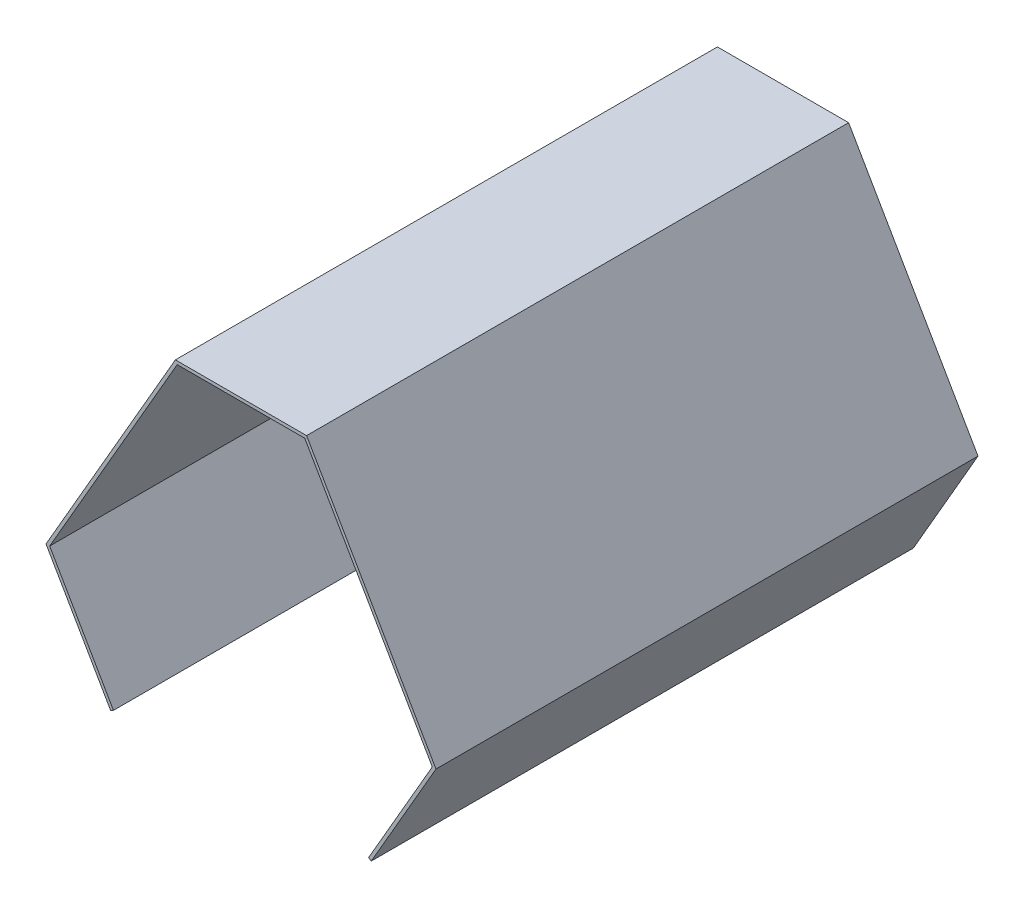
ISO-10303-21;
HEADER;
FILE_DESCRIPTION(('STEP AP214'),'2;1');
FILE_NAME('part.step','',(''),(''),'','','');
FILE_SCHEMA(('AUTOMOTIVE_DESIGN { 1 0 10303 214 1 1 1 1 }'));
ENDSEC;
DATA;
#1=APPLICATION_CONTEXT('core data for automotive mechanical design processes');
#2=APPLICATION_PROTOCOL_DEFINITION('international standard','automotive_design',2000,#1);
#3=PRODUCT_CONTEXT('',#1,'mechanical');
#4=PRODUCT('Part','Part','',(#3));
#5=PRODUCT_RELATED_PRODUCT_CATEGORY('part','',(#4));
#6=PRODUCT_DEFINITION_FORMATION('','',#4);
#7=PRODUCT_DEFINITION_CONTEXT('part definition',#1,'design');
#8=PRODUCT_DEFINITION('design','',#6,#7);
#9=PRODUCT_DEFINITION_SHAPE('','',#8);
#10=(LENGTH_UNIT() NAMED_UNIT(*) SI_UNIT(.MILLI.,.METRE.));
#11=(NAMED_UNIT(*) PLANE_ANGLE_UNIT() SI_UNIT($,.RADIAN.));
#12=(NAMED_UNIT(*) SI_UNIT($,.STERADIAN.) SOLID_ANGLE_UNIT());
#13=UNCERTAINTY_MEASURE_WITH_UNIT(LENGTH_MEASURE(1.E-05),#10,'distance_accuracy_value','');
#14=(GEOMETRIC_REPRESENTATION_CONTEXT(3) GLOBAL_UNCERTAINTY_ASSIGNED_CONTEXT((#13)) GLOBAL_UNIT_ASSIGNED_CONTEXT((#10,
#11,#12)) REPRESENTATION_CONTEXT('',''));
#15=CARTESIAN_POINT('',(0.,0.,0.));
#16=DIRECTION('',(0.,0.,1.));
#17=DIRECTION('',(1.,0.,0.));
#18=AXIS2_PLACEMENT_3D('',#15,#16,#17);
#19=CARTESIAN_POINT('',(299.999999999999,-86.6025405137754,850.));
#20=DIRECTION('',(0.866025403784441,-0.499999999999996,0.));
#21=DIRECTION('',(0.499999999999996,0.866025403784441,0.));
#22=AXIS2_PLACEMENT_3D('',#19,#20,#21);
#23=PLANE('',#22);
#24=DIRECTION('',(-0.499999999999996,-0.866025403784441,0.));
#25=VECTOR('',#24,1.);
#26=CARTESIAN_POINT('',(299.999999999999,-86.6025405137754,0.));
#27=LINE('',#26,#25);
#28=CARTESIAN_POINT('',(299.999999999999,-86.6025405137754,0.));
#29=VERTEX_POINT('',#28);
#30=CARTESIAN_POINT('',(200.,-259.807621270664,0.));
#31=VERTEX_POINT('',#30);
#32=EDGE_CURVE('E158',#29,#31,#27,.T.);
#33=ORIENTED_EDGE('',*,*,#32,.T.);
#34=DIRECTION('',(0.,0.,-1.));
#35=VECTOR('',#34,1.);
#36=CARTESIAN_POINT('',(200.,-259.807621270664,850.));
#37=LINE('',#36,#35);
#38=CARTESIAN_POINT('',(200.,-259.807621270664,850.));
#39=VERTEX_POINT('',#38);
#40=EDGE_CURVE('E11',#39,#31,#37,.T.);
#41=ORIENTED_EDGE('',*,*,#40,.F.);
#42=DIRECTION('',(-0.499999999999996,-0.866025403784441,0.));
#43=VECTOR('',#42,1.);
#44=CARTESIAN_POINT('',(299.999999999999,-86.6025405137754,850.));
#45=LINE('',#44,#43);
#46=CARTESIAN_POINT('',(299.999999999999,-86.6025405137754,850.));
#47=VERTEX_POINT('',#46);
#48=EDGE_CURVE('E180',#47,#39,#45,.T.);
#49=ORIENTED_EDGE('',*,*,#48,.F.);
#50=DIRECTION('',(0.,0.,-1.));
#51=VECTOR('',#50,1.);
#52=CARTESIAN_POINT('',(299.999999999999,-86.6025405137754,850.));
#53=LINE('',#52,#51);
#54=EDGE_CURVE('E154',#47,#29,#53,.T.);
#55=ORIENTED_EDGE('',*,*,#54,.T.);
#56=EDGE_LOOP('',(#33,#41,#49,#55));
#57=FACE_BOUND('',#56,.T.);
#58=ADVANCED_FACE('F38',(#57),#23,.F.);
#59=CARTESIAN_POINT('',(200.,-259.807621270664,850.));
#60=DIRECTION('',(0.500000000000009,0.866025403784433,0.));
#61=DIRECTION('',(-0.866025403784433,0.500000000000009,0.));
#62=AXIS2_PLACEMENT_3D('',#59,#60,#61);
#63=PLANE('',#62);
#64=DIRECTION('',(0.866025403784433,-0.500000000000009,0.));
#65=VECTOR('',#64,1.);
#66=CARTESIAN_POINT('',(200.,-259.807621270664,0.));
#67=LINE('',#66,#65);
#68=CARTESIAN_POINT('',(204.330127018921,-262.307621270663,0.));
#69=VERTEX_POINT('',#68);
#70=EDGE_CURVE('E161',#31,#69,#67,.T.);
#71=ORIENTED_EDGE('',*,*,#70,.T.);
#72=DIRECTION('',(0.,0.,-1.));
#73=VECTOR('',#72,1.);
#74=CARTESIAN_POINT('',(204.330127018921,-262.307621270663,850.));
#75=LINE('',#74,#73);
#76=CARTESIAN_POINT('',(204.330127018921,-262.307621270663,850.));
#77=VERTEX_POINT('',#76);
#78=EDGE_CURVE('E46',#77,#69,#75,.T.);
#79=ORIENTED_EDGE('',*,*,#78,.F.);
#80=DIRECTION('',(0.866025403784433,-0.500000000000009,0.));
#81=VECTOR('',#80,1.);
#82=CARTESIAN_POINT('',(200.,-259.807621270664,850.));
#83=LINE('',#82,#81);
#84=EDGE_CURVE('E109',#39,#77,#83,.T.);
#85=ORIENTED_EDGE('',*,*,#84,.F.);
#86=ORIENTED_EDGE('',*,*,#40,.T.);
#87=EDGE_LOOP('',(#71,#79,#85,#86));
#88=FACE_BOUND('',#87,.T.);
#89=ADVANCED_FACE('F258',(#88),#63,.F.);
#90=CARTESIAN_POINT('',(305.773502691895,-86.6025405137754,850.));
#91=DIRECTION('',(-0.866025403784438,0.5,0.));
#92=DIRECTION('',(-0.5,-0.866025403784439,0.));
#93=AXIS2_PLACEMENT_3D('',#90,#91,#92);
#94=PLANE('',#93);
#95=DIRECTION('',(0.5,0.866025403784438,0.));
#96=VECTOR('',#95,1.);
#97=CARTESIAN_POINT('',(305.773502691895,-86.6025405137754,0.));
#98=LINE('',#97,#96);
#99=CARTESIAN_POINT('',(305.773502691895,-86.6025405137754,0.));
#100=VERTEX_POINT('',#99);
#101=EDGE_CURVE('E163',#69,#100,#98,.T.);
#102=ORIENTED_EDGE('',*,*,#101,.T.);
#103=DIRECTION('',(0.,0.,-1.));
#104=VECTOR('',#103,1.);
#105=CARTESIAN_POINT('',(305.773502691895,-86.6025405137754,850.));
#106=LINE('',#105,#104);
#107=CARTESIAN_POINT('',(305.773502691895,-86.6025405137754,850.));
#108=VERTEX_POINT('',#107);
#109=EDGE_CURVE('E199',#108,#100,#106,.T.);
#110=ORIENTED_EDGE('',*,*,#109,.F.);
#111=DIRECTION('',(0.5,0.866025403784438,0.));
#112=VECTOR('',#111,1.);
#113=CARTESIAN_POINT('',(305.773502691895,-86.6025405137754,850.));
#114=LINE('',#113,#112);
#115=EDGE_CURVE('E207',#77,#108,#114,.T.);
#116=ORIENTED_EDGE('',*,*,#115,.F.);
#117=ORIENTED_EDGE('',*,*,#78,.T.);
#118=EDGE_LOOP('',(#102,#110,#116,#117));
#119=FACE_BOUND('',#118,.T.);
#120=ADVANCED_FACE('F205',(#119),#94,.F.);
#121=CARTESIAN_POINT('',(102.886751345947,264.807621,850.));
#122=DIRECTION('',(-0.866025403784438,-0.5,0.));
#123=DIRECTION('',(0.5,-0.866025403784439,0.));
#124=AXIS2_PLACEMENT_3D('',#121,#122,#123);
#125=PLANE('',#124);
#126=DIRECTION('',(-0.5,0.866025403784439,0.));
#127=VECTOR('',#126,1.);
#128=CARTESIAN_POINT('',(102.886751345947,264.807621,0.));
#129=LINE('',#128,#127);
#130=CARTESIAN_POINT('',(102.886751345947,264.807621,0.));
#131=VERTEX_POINT('',#130);
#132=EDGE_CURVE('E165',#100,#131,#129,.T.);
#133=ORIENTED_EDGE('',*,*,#132,.T.);
#134=DIRECTION('',(0.,0.,-1.));
#135=VECTOR('',#134,1.);
#136=CARTESIAN_POINT('',(102.886751345947,264.807621,850.));
#137=LINE('',#136,#135);
#138=CARTESIAN_POINT('',(102.886751345947,264.807621,850.));
#139=VERTEX_POINT('',#138);
#140=EDGE_CURVE('E196',#139,#131,#137,.T.);
#141=ORIENTED_EDGE('',*,*,#140,.F.);
#142=DIRECTION('',(-0.5,0.866025403784439,0.));
#143=VECTOR('',#142,1.);
#144=CARTESIAN_POINT('',(102.886751345947,264.807621,850.));
#145=LINE('',#144,#143);
#146=EDGE_CURVE('E225',#108,#139,#145,.T.);
#147=ORIENTED_EDGE('',*,*,#146,.F.);
#148=ORIENTED_EDGE('',*,*,#109,.T.);
#149=EDGE_LOOP('',(#133,#141,#147,#148));
#150=FACE_BOUND('',#149,.T.);
#151=ADVANCED_FACE('F216',(#150),#125,.F.);
#152=CARTESIAN_POINT('',(-102.886751345948,264.807621,850.));
#153=DIRECTION('',(0.,-1.,0.));
#154=DIRECTION('',(0.,0.,-1.));
#155=AXIS2_PLACEMENT_3D('',#152,#153,#154);
#156=PLANE('',#155);
#157=DIRECTION('',(-1.,0.,0.));
#158=VECTOR('',#157,1.);
#159=CARTESIAN_POINT('',(-102.886751345948,264.807621,0.));
#160=LINE('',#159,#158);
#161=CARTESIAN_POINT('',(-102.886751345948,264.807621,0.));
#162=VERTEX_POINT('',#161);
#163=EDGE_CURVE('E167',#131,#162,#160,.T.);
#164=ORIENTED_EDGE('',*,*,#163,.T.);
#165=DIRECTION('',(0.,0.,-1.));
#166=VECTOR('',#165,1.);
#167=CARTESIAN_POINT('',(-102.886751345948,264.807621,850.));
#168=LINE('',#167,#166);
#169=CARTESIAN_POINT('',(-102.886751345948,264.807621,850.));
#170=VERTEX_POINT('',#169);
#171=EDGE_CURVE('E193',#170,#162,#168,.T.);
#172=ORIENTED_EDGE('',*,*,#171,.F.);
#173=DIRECTION('',(-1.,0.,0.));
#174=VECTOR('',#173,1.);
#175=CARTESIAN_POINT('',(-102.886751345948,264.807621,850.));
#176=LINE('',#175,#174);
#177=EDGE_CURVE('E222',#139,#170,#176,.T.);
#178=ORIENTED_EDGE('',*,*,#177,.F.);
#179=ORIENTED_EDGE('',*,*,#140,.T.);
#180=EDGE_LOOP('',(#164,#172,#178,#179));
#181=FACE_BOUND('',#180,.T.);
#182=ADVANCED_FACE('F220',(#181),#156,.F.);
#183=CARTESIAN_POINT('',(-305.773502691896,-86.602540513776,850.));
#184=DIRECTION('',(0.866025403784438,-0.5,0.));
#185=DIRECTION('',(0.5,0.866025403784439,0.));
#186=AXIS2_PLACEMENT_3D('',#183,#184,#185);
#187=PLANE('',#186);
#188=DIRECTION('',(-0.5,-0.866025403784438,0.));
#189=VECTOR('',#188,1.);
#190=CARTESIAN_POINT('',(-305.773502691896,-86.602540513776,0.));
#191=LINE('',#190,#189);
#192=CARTESIAN_POINT('',(-305.773502691896,-86.602540513776,0.));
#193=VERTEX_POINT('',#192);
#194=EDGE_CURVE('E169',#162,#193,#191,.T.);
#195=ORIENTED_EDGE('',*,*,#194,.T.);
#196=DIRECTION('',(0.,0.,-1.));
#197=VECTOR('',#196,1.);
#198=CARTESIAN_POINT('',(-305.773502691896,-86.602540513776,850.));
#199=LINE('',#198,#197);
#200=CARTESIAN_POINT('',(-305.773502691896,-86.602540513776,850.));
#201=VERTEX_POINT('',#200);
#202=EDGE_CURVE('E190',#201,#193,#199,.T.);
#203=ORIENTED_EDGE('',*,*,#202,.F.);
#204=DIRECTION('',(-0.5,-0.866025403784438,0.));
#205=VECTOR('',#204,1.);
#206=CARTESIAN_POINT('',(-305.773502691896,-86.602540513776,850.));
#207=LINE('',#206,#205);
#208=EDGE_CURVE('E224',#170,#201,#207,.T.);
#209=ORIENTED_EDGE('',*,*,#208,.F.);
#210=ORIENTED_EDGE('',*,*,#171,.T.);
#211=EDGE_LOOP('',(#195,#203,#209,#210));
#212=FACE_BOUND('',#211,.T.);
#213=ADVANCED_FACE('F271',(#212),#187,.F.);
#214=CARTESIAN_POINT('',(-204.330127018922,-262.307621270664,850.));
#215=DIRECTION('',(0.866025403784438,0.5,0.));
#216=DIRECTION('',(-0.5,0.866025403784439,0.));
#217=AXIS2_PLACEMENT_3D('',#214,#215,#216);
#218=PLANE('',#217);
#219=DIRECTION('',(0.5,-0.866025403784439,0.));
#220=VECTOR('',#219,1.);
#221=CARTESIAN_POINT('',(-204.330127018922,-262.307621270664,0.));
#222=LINE('',#221,#220);
#223=CARTESIAN_POINT('',(-204.330127018922,-262.307621270664,0.));
#224=VERTEX_POINT('',#223);
#225=EDGE_CURVE('E171',#193,#224,#222,.T.);
#226=ORIENTED_EDGE('',*,*,#225,.T.);
#227=DIRECTION('',(0.,0.,-1.));
#228=VECTOR('',#227,1.);
#229=CARTESIAN_POINT('',(-204.330127018922,-262.307621270664,850.));
#230=LINE('',#229,#228);
#231=CARTESIAN_POINT('',(-204.330127018922,-262.307621270664,850.));
#232=VERTEX_POINT('',#231);
#233=EDGE_CURVE('E187',#232,#224,#230,.T.);
#234=ORIENTED_EDGE('',*,*,#233,.F.);
#235=DIRECTION('',(0.5,-0.866025403784439,0.));
#236=VECTOR('',#235,1.);
#237=CARTESIAN_POINT('',(-204.330127018922,-262.307621270664,850.));
#238=LINE('',#237,#236);
#239=EDGE_CURVE('E227',#201,#232,#238,.T.);
#240=ORIENTED_EDGE('',*,*,#239,.F.);
#241=ORIENTED_EDGE('',*,*,#202,.T.);
#242=EDGE_LOOP('',(#226,#234,#240,#241));
#243=FACE_BOUND('',#242,.T.);
#244=ADVANCED_FACE('F274',(#243),#218,.F.);
#245=CARTESIAN_POINT('',(-204.330127018922,-262.307621270664,850.));
#246=DIRECTION('',(-0.500000000000001,0.866025403784438,0.));
#247=DIRECTION('',(-0.866025403784438,-0.500000000000001,0.));
#248=AXIS2_PLACEMENT_3D('',#245,#246,#247);
#249=PLANE('',#248);
#250=DIRECTION('',(0.866025403784438,0.500000000000001,0.));
#251=VECTOR('',#250,1.);
#252=CARTESIAN_POINT('',(-204.330127018922,-262.307621270664,0.));
#253=LINE('',#252,#251);
#254=CARTESIAN_POINT('',(-200.,-259.807621270664,0.));
#255=VERTEX_POINT('',#254);
#256=EDGE_CURVE('E173',#224,#255,#253,.T.);
#257=ORIENTED_EDGE('',*,*,#256,.T.);
#258=DIRECTION('',(0.,0.,-1.));
#259=VECTOR('',#258,1.);
#260=CARTESIAN_POINT('',(-200.,-259.807621270664,850.));
#261=LINE('',#260,#259);
#262=CARTESIAN_POINT('',(-200.,-259.807621270664,850.));
#263=VERTEX_POINT('',#262);
#264=EDGE_CURVE('E184',#263,#255,#261,.T.);
#265=ORIENTED_EDGE('',*,*,#264,.F.);
#266=DIRECTION('',(0.866025403784438,0.500000000000001,0.));
#267=VECTOR('',#266,1.);
#268=CARTESIAN_POINT('',(-204.330127018922,-262.307621270664,850.));
#269=LINE('',#268,#267);
#270=EDGE_CURVE('E233',#232,#263,#269,.T.);
#271=ORIENTED_EDGE('',*,*,#270,.F.);
#272=ORIENTED_EDGE('',*,*,#233,.T.);
#273=EDGE_LOOP('',(#257,#265,#271,#272));
#274=FACE_BOUND('',#273,.T.);
#275=ADVANCED_FACE('F239',(#274),#249,.F.);
#276=CARTESIAN_POINT('',(-200.,-259.807621270664,850.));
#277=DIRECTION('',(-0.866025403784439,-0.5,0.));
#278=DIRECTION('',(0.5,-0.866025403784439,0.));
#279=AXIS2_PLACEMENT_3D('',#276,#277,#278);
#280=PLANE('',#279);
#281=DIRECTION('',(-0.5,0.866025403784439,0.));
#282=VECTOR('',#281,1.);
#283=CARTESIAN_POINT('',(-200.,-259.807621270664,0.));
#284=LINE('',#283,#282);
#285=CARTESIAN_POINT('',(-300.,-86.602540513776,0.));
#286=VERTEX_POINT('',#285);
#287=EDGE_CURVE('E175',#255,#286,#284,.T.);
#288=ORIENTED_EDGE('',*,*,#287,.T.);
#289=DIRECTION('',(0.,0.,-1.));
#290=VECTOR('',#289,1.);
#291=CARTESIAN_POINT('',(-300.,-86.602540513776,850.));
#292=LINE('',#291,#290);
#293=CARTESIAN_POINT('',(-300.,-86.602540513776,850.));
#294=VERTEX_POINT('',#293);
#295=EDGE_CURVE('E149',#294,#286,#292,.T.);
#296=ORIENTED_EDGE('',*,*,#295,.F.);
#297=DIRECTION('',(-0.5,0.866025403784439,0.));
#298=VECTOR('',#297,1.);
#299=CARTESIAN_POINT('',(-200.,-259.807621270664,850.));
#300=LINE('',#299,#298);
#301=EDGE_CURVE('E140',#263,#294,#300,.T.);
#302=ORIENTED_EDGE('',*,*,#301,.F.);
#303=ORIENTED_EDGE('',*,*,#264,.T.);
#304=EDGE_LOOP('',(#288,#296,#302,#303));
#305=FACE_BOUND('',#304,.T.);
#306=ADVANCED_FACE('F243',(#305),#280,.F.);
#307=CARTESIAN_POINT('',(-300.,-86.602540513776,850.));
#308=DIRECTION('',(-0.86602540378444,0.499999999999998,0.));
#309=DIRECTION('',(-0.499999999999998,-0.86602540378444,0.));
#310=AXIS2_PLACEMENT_3D('',#307,#308,#309);
#311=PLANE('',#310);
#312=DIRECTION('',(0.499999999999998,0.86602540378444,0.));
#313=VECTOR('',#312,1.);
#314=CARTESIAN_POINT('',(-300.,-86.602540513776,0.));
#315=LINE('',#314,#313);
#316=CARTESIAN_POINT('',(-100.000000000001,259.807621,0.));
#317=VERTEX_POINT('',#316);
#318=EDGE_CURVE('E148',#286,#317,#315,.T.);
#319=ORIENTED_EDGE('',*,*,#318,.T.);
#320=DIRECTION('',(0.,0.,-1.));
#321=VECTOR('',#320,1.);
#322=CARTESIAN_POINT('',(-100.000000000001,259.807621,850.));
#323=LINE('',#322,#321);
#324=CARTESIAN_POINT('',(-100.000000000001,259.807621,850.));
#325=VERTEX_POINT('',#324);
#326=EDGE_CURVE('E145',#325,#317,#323,.T.);
#327=ORIENTED_EDGE('',*,*,#326,.F.);
#328=DIRECTION('',(0.499999999999998,0.86602540378444,0.));
#329=VECTOR('',#328,1.);
#330=CARTESIAN_POINT('',(-300.,-86.602540513776,850.));
#331=LINE('',#330,#329);
#332=EDGE_CURVE('E134',#294,#325,#331,.T.);
#333=ORIENTED_EDGE('',*,*,#332,.F.);
#334=ORIENTED_EDGE('',*,*,#295,.T.);
#335=EDGE_LOOP('',(#319,#327,#333,#334));
#336=FACE_BOUND('',#335,.T.);
#337=ADVANCED_FACE('F146',(#336),#311,.F.);
#338=CARTESIAN_POINT('',(-100.000000000001,259.807621,850.));
#339=DIRECTION('',(0.,1.,0.));
#340=DIRECTION('',(-1.,0.,0.));
#341=AXIS2_PLACEMENT_3D('',#338,#339,#340);
#342=PLANE('',#341);
#343=DIRECTION('',(1.,0.,0.));
#344=VECTOR('',#343,1.);
#345=CARTESIAN_POINT('',(-100.000000000001,259.807621,0.));
#346=LINE('',#345,#344);
#347=CARTESIAN_POINT('',(99.9999999999992,259.807621,0.));
#348=VERTEX_POINT('',#347);
#349=EDGE_CURVE('E95',#317,#348,#346,.T.);
#350=ORIENTED_EDGE('',*,*,#349,.T.);
#351=DIRECTION('',(0.,0.,-1.));
#352=VECTOR('',#351,1.);
#353=CARTESIAN_POINT('',(99.9999999999992,259.807621,850.));
#354=LINE('',#353,#352);
#355=CARTESIAN_POINT('',(99.9999999999992,259.807621,850.));
#356=VERTEX_POINT('',#355);
#357=EDGE_CURVE('E150',#356,#348,#354,.T.);
#358=ORIENTED_EDGE('',*,*,#357,.F.);
#359=DIRECTION('',(1.,0.,0.));
#360=VECTOR('',#359,1.);
#361=CARTESIAN_POINT('',(-100.000000000001,259.807621,850.));
#362=LINE('',#361,#360);
#363=EDGE_CURVE('E138',#325,#356,#362,.T.);
#364=ORIENTED_EDGE('',*,*,#363,.F.);
#365=ORIENTED_EDGE('',*,*,#326,.T.);
#366=EDGE_LOOP('',(#350,#358,#364,#365));
#367=FACE_BOUND('',#366,.T.);
#368=ADVANCED_FACE('F152',(#367),#342,.F.);
#369=CARTESIAN_POINT('',(99.9999999999992,259.807621,850.));
#370=DIRECTION('',(0.866025403784438,0.5,0.));
#371=DIRECTION('',(-0.5,0.866025403784439,0.));
#372=AXIS2_PLACEMENT_3D('',#369,#370,#371);
#373=PLANE('',#372);
#374=DIRECTION('',(0.5,-0.866025403784438,0.));
#375=VECTOR('',#374,1.);
#376=CARTESIAN_POINT('',(99.9999999999992,259.807621,0.));
#377=LINE('',#376,#375);
#378=EDGE_CURVE('E101',#348,#29,#377,.T.);
#379=ORIENTED_EDGE('',*,*,#378,.T.);
#380=ORIENTED_EDGE('',*,*,#54,.F.);
#381=DIRECTION('',(0.5,-0.866025403784438,0.));
#382=VECTOR('',#381,1.);
#383=CARTESIAN_POINT('',(99.9999999999992,259.807621,850.));
#384=LINE('',#383,#382);
#385=EDGE_CURVE('E54',#356,#47,#384,.T.);
#386=ORIENTED_EDGE('',*,*,#385,.F.);
#387=ORIENTED_EDGE('',*,*,#357,.T.);
#388=EDGE_LOOP('',(#379,#380,#386,#387));
#389=FACE_BOUND('',#388,.T.);
#390=ADVANCED_FACE('F247',(#389),#373,.F.);
#391=CARTESIAN_POINT('',(0.,0.,850.));
#392=DIRECTION('',(0.,0.,1.));
#393=DIRECTION('',(1.,0.,0.));
#394=AXIS2_PLACEMENT_3D('',#391,#392,#393);
#395=PLANE('',#394);
#396=ORIENTED_EDGE('',*,*,#48,.T.);
#397=ORIENTED_EDGE('',*,*,#84,.T.);
#398=ORIENTED_EDGE('',*,*,#115,.T.);
#399=ORIENTED_EDGE('',*,*,#146,.T.);
#400=ORIENTED_EDGE('',*,*,#177,.T.);
#401=ORIENTED_EDGE('',*,*,#208,.T.);
#402=ORIENTED_EDGE('',*,*,#239,.T.);
#403=ORIENTED_EDGE('',*,*,#270,.T.);
#404=ORIENTED_EDGE('',*,*,#301,.T.);
#405=ORIENTED_EDGE('',*,*,#332,.T.);
#406=ORIENTED_EDGE('',*,*,#363,.T.);
#407=ORIENTED_EDGE('',*,*,#385,.T.);
#408=EDGE_LOOP('',(#396,#397,#398,#399,#400,#401,#402,#403,#404,#405,#406,#407));
#409=FACE_BOUND('',#408,.T.);
#410=ADVANCED_FACE('F136',(#409),#395,.T.);
#411=CARTESIAN_POINT('',(0.,0.,0.));
#412=DIRECTION('',(0.,0.,1.));
#413=DIRECTION('',(1.,0.,0.));
#414=AXIS2_PLACEMENT_3D('',#411,#412,#413);
#415=PLANE('',#414);
#416=ORIENTED_EDGE('',*,*,#32,.F.);
#417=ORIENTED_EDGE('',*,*,#378,.F.);
#418=ORIENTED_EDGE('',*,*,#349,.F.);
#419=ORIENTED_EDGE('',*,*,#318,.F.);
#420=ORIENTED_EDGE('',*,*,#287,.F.);
#421=ORIENTED_EDGE('',*,*,#256,.F.);
#422=ORIENTED_EDGE('',*,*,#225,.F.);
#423=ORIENTED_EDGE('',*,*,#194,.F.);
#424=ORIENTED_EDGE('',*,*,#163,.F.);
#425=ORIENTED_EDGE('',*,*,#132,.F.);
#426=ORIENTED_EDGE('',*,*,#101,.F.);
#427=ORIENTED_EDGE('',*,*,#70,.F.);
#428=EDGE_LOOP('',(#416,#417,#418,#419,#420,#421,#422,#423,#424,#425,#426,#427));
#429=FACE_BOUND('',#428,.T.);
#430=ADVANCED_FACE('F211',(#429),#415,.F.);
#431=CLOSED_SHELL('',(#58,#89,#120,#151,#182,#213,#244,#275,#306,#337,#368,#390,#410,#430));
#432=MANIFOLD_SOLID_BREP('B2',#431);
#433=ADVANCED_BREP_SHAPE_REPRESENTATION('',(#18,#432),#14);
#434=SHAPE_DEFINITION_REPRESENTATION(#9,#433);
ENDSEC;
END-ISO-10303-21;
